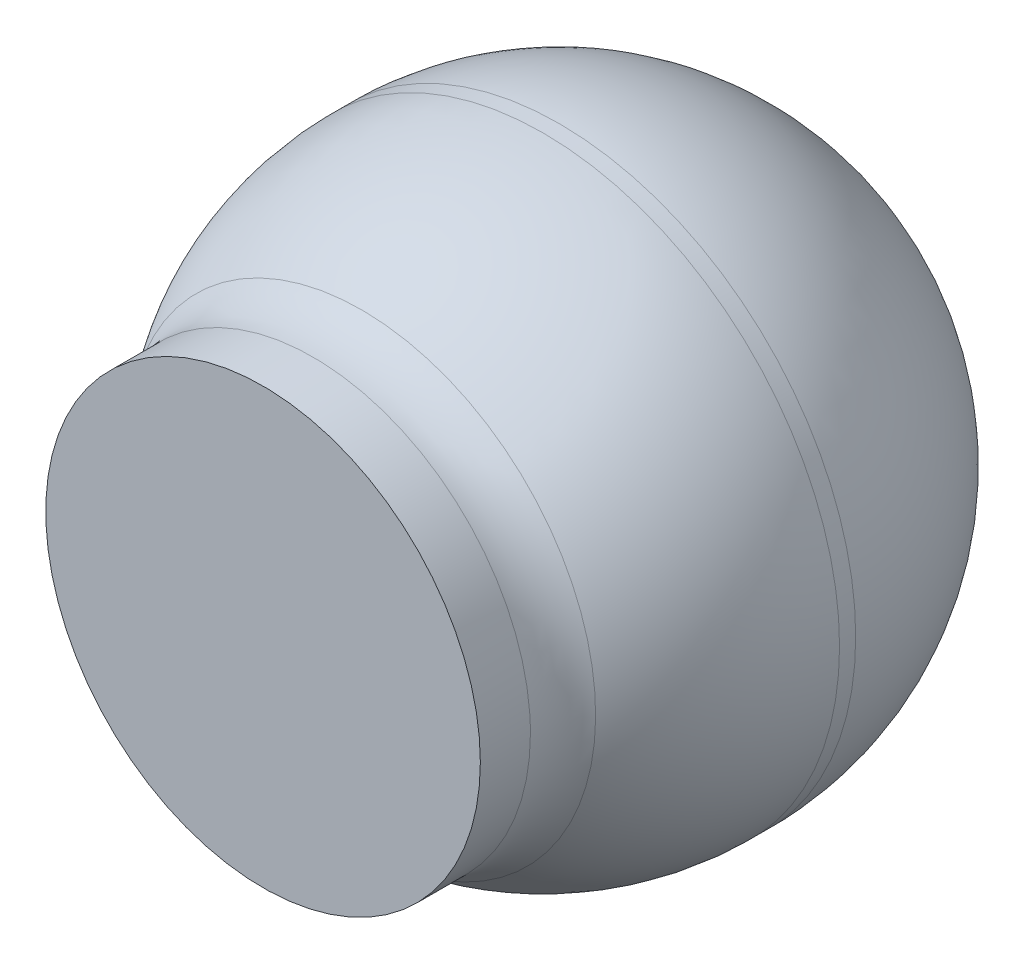
ISO-10303-21;
HEADER;
FILE_DESCRIPTION(('STEP AP214'),'2;1');
FILE_NAME('part.step','',(''),(''),'','','');
FILE_SCHEMA(('AUTOMOTIVE_DESIGN { 1 0 10303 214 1 1 1 1 }'));
ENDSEC;
DATA;
#1=APPLICATION_CONTEXT('core data for automotive mechanical design processes');
#2=APPLICATION_PROTOCOL_DEFINITION('international standard','automotive_design',2000,#1);
#3=PRODUCT_CONTEXT('',#1,'mechanical');
#4=PRODUCT('Part','Part','',(#3));
#5=PRODUCT_RELATED_PRODUCT_CATEGORY('part','',(#4));
#6=PRODUCT_DEFINITION_FORMATION('','',#4);
#7=PRODUCT_DEFINITION_CONTEXT('part definition',#1,'design');
#8=PRODUCT_DEFINITION('design','',#6,#7);
#9=PRODUCT_DEFINITION_SHAPE('','',#8);
#10=(LENGTH_UNIT() NAMED_UNIT(*) SI_UNIT(.MILLI.,.METRE.));
#11=(NAMED_UNIT(*) PLANE_ANGLE_UNIT() SI_UNIT($,.RADIAN.));
#12=(NAMED_UNIT(*) SI_UNIT($,.STERADIAN.) SOLID_ANGLE_UNIT());
#13=UNCERTAINTY_MEASURE_WITH_UNIT(LENGTH_MEASURE(1.E-05),#10,'distance_accuracy_value','');
#14=(GEOMETRIC_REPRESENTATION_CONTEXT(3) GLOBAL_UNCERTAINTY_ASSIGNED_CONTEXT((#13)) GLOBAL_UNIT_ASSIGNED_CONTEXT((#10,
#11,#12)) REPRESENTATION_CONTEXT('',''));
#15=CARTESIAN_POINT('',(0.,0.,0.));
#16=DIRECTION('',(0.,0.,1.));
#17=DIRECTION('',(1.,0.,0.));
#18=AXIS2_PLACEMENT_3D('',#15,#16,#17);
#19=CARTESIAN_POINT('',(-3.102919922269,-0.241349291452,10.006534503384));
#20=DIRECTION('',(0.,0.,-1.));
#21=DIRECTION('',(-1.,0.,0.));
#22=AXIS2_PLACEMENT_3D('',#19,#20,#21);
#23=PLANE('',#22);
#24=CARTESIAN_POINT('',(-3.102919922269,-0.241349291452,10.006534503384));
#25=DIRECTION('',(0.,0.,1.));
#26=DIRECTION('',(1.,0.,0.));
#27=AXIS2_PLACEMENT_3D('',#24,#25,#26);
#28=CIRCLE('',#27,0.275);
#29=CARTESIAN_POINT('',(-2.827919922269,-0.241349291452,10.006534503384));
#30=VERTEX_POINT('',#29);
#31=EDGE_CURVE('E20',#30,#30,#28,.F.);
#32=ORIENTED_EDGE('',*,*,#31,.F.);
#33=EDGE_LOOP('',(#32));
#34=FACE_BOUND('',#33,.T.);
#35=ADVANCED_FACE('F17',(#34),#23,.F.);
#36=CARTESIAN_POINT('',(-3.102919922269,-0.241349291452,9.906534503384));
#37=DIRECTION('',(0.,0.,1.));
#38=DIRECTION('',(1.,0.,0.));
#39=AXIS2_PLACEMENT_3D('',#36,#37,#38);
#40=CYLINDRICAL_SURFACE('',#39,0.275);
#41=CARTESIAN_POINT('',(-3.102919922269,-0.241349291452,9.943180457728));
#42=DIRECTION('',(0.,0.,-1.));
#43=DIRECTION('',(0.996700902337582,0.0811622527992461,0.));
#44=AXIS2_PLACEMENT_3D('',#41,#42,#43);
#45=CIRCLE('',#44,0.275);
#46=CARTESIAN_POINT('',(-2.82882717412616,-0.219029671932207,9.943180457728));
#47=VERTEX_POINT('',#46);
#48=EDGE_CURVE('E65',#47,#47,#45,.F.);
#49=ORIENTED_EDGE('',*,*,#48,.T.);
#50=EDGE_LOOP('',(#49));
#51=FACE_BOUND('',#50,.T.);
#52=ORIENTED_EDGE('',*,*,#31,.T.);
#53=EDGE_LOOP('',(#52));
#54=FACE_BOUND('',#53,.T.);
#55=ADVANCED_FACE('F62',(#51,#54),#40,.T.);
#56=CARTESIAN_POINT('',(-3.102919922269,-0.241349291452,9.943180457728));
#57=DIRECTION('',(0.,0.,-1.));
#58=DIRECTION('',(0.996700902337583,0.081162252799246,0.));
#59=AXIS2_PLACEMENT_3D('',#56,#57,#58);
#60=TOROIDAL_SURFACE('',#59,0.375,0.1);
#61=ORIENTED_EDGE('',*,*,#48,.F.);
#62=EDGE_LOOP('',(#61));
#63=FACE_BOUND('',#62,.T.);
#64=CARTESIAN_POINT('',(-3.102919922269,-0.241349291452,9.881744931236));
#65=DIRECTION('',(0.,0.,-1.));
#66=DIRECTION('',(-0.996700902337598,-0.0811622527990606,0.));
#67=AXIS2_PLACEMENT_3D('',#64,#65,#66);
#68=CIRCLE('',#67,0.296097046412665);
#69=CARTESIAN_POINT('',(-3.398040115608,-0.265381194786,9.881744931236));
#70=VERTEX_POINT('',#69);
#71=EDGE_CURVE('E39',#70,#70,#68,.T.);
#72=ORIENTED_EDGE('',*,*,#71,.F.);
#73=EDGE_LOOP('',(#72));
#74=FACE_BOUND('',#73,.T.);
#75=ADVANCED_FACE('F57',(#63,#74),#60,.F.);
#76=CARTESIAN_POINT('',(-3.476682760645,-0.271785136252,9.651976062157));
#77=CARTESIAN_POINT('',(-3.476682760645,-0.271785136252,9.701461392103));
#78=CARTESIAN_POINT('',(-3.468526217348,-0.271120941579,9.750947004335));
#79=CARTESIAN_POINT('',(-3.452207085349,-0.269792059952,9.798626332798));
#80=CARTESIAN_POINT('',(-3.428341390838,-0.267848654938,9.842699544317));
#81=CARTESIAN_POINT('',(-3.398040115608,-0.265381194786,9.881744931236));
#82=(BOUNDED_CURVE() B_SPLINE_CURVE(5,(#76,#77,#78,#79,#80,#81),.UNSPECIFIED.,.F.,
.F.) B_SPLINE_CURVE_WITH_KNOTS((6,6),(0.,0.661568582165),
.UNSPECIFIED.) CURVE() GEOMETRIC_REPRESENTATION_ITEM() RATIONAL_B_SPLINE_CURVE((1.,1.,1.,1.,1.,1.)) REPRESENTATION_ITEM(''));
#83=CARTESIAN_POINT('',(-3.102919922269,-0.241349291452,9.651976062157));
#84=DIRECTION('',(0.,0.,-1.));
#85=AXIS1_PLACEMENT('',#83,#84);
#86=SURFACE_OF_REVOLUTION('',#82,#85);
#87=CARTESIAN_POINT('',(-3.102919922269,-0.241349291452,9.651976062157));
#88=DIRECTION('',(0.,0.,1.));
#89=DIRECTION('',(1.,0.,0.));
#90=AXIS2_PLACEMENT_3D('',#87,#88,#89);
#91=CIRCLE('',#90,0.375);
#92=CARTESIAN_POINT('',(-2.727919922269,-0.241349291452,9.651976062157));
#93=VERTEX_POINT('',#92);
#94=EDGE_CURVE('E36',#93,#93,#91,.F.);
#95=ORIENTED_EDGE('',*,*,#94,.F.);
#96=EDGE_LOOP('',(#95));
#97=FACE_BOUND('',#96,.T.);
#98=ORIENTED_EDGE('',*,*,#71,.T.);
#99=EDGE_LOOP('',(#98));
#100=FACE_BOUND('',#99,.T.);
#101=ADVANCED_FACE('F53',(#97,#100),#86,.F.);
#102=CARTESIAN_POINT('',(-3.102919922269,-0.241349291452,9.256534503384));
#103=DIRECTION('',(0.,0.,1.));
#104=DIRECTION('',(1.,0.,0.));
#105=AXIS2_PLACEMENT_3D('',#102,#103,#104);
#106=CYLINDRICAL_SURFACE('',#105,0.375);
#107=CARTESIAN_POINT('',(-3.102919922269,-0.241349291452,9.631534503384));
#108=DIRECTION('',(0.,0.,-1.));
#109=DIRECTION('',(0.0811622527992356,-0.996700902337583,0.));
#110=AXIS2_PLACEMENT_3D('',#107,#108,#109);
#111=CIRCLE('',#110,0.375);
#112=CARTESIAN_POINT('',(-3.07248407746929,-0.615112129828594,9.631534503384));
#113=VERTEX_POINT('',#112);
#114=CARTESIAN_POINT('',(-3.13335576706871,0.132413546924594,9.631534503384));
#115=VERTEX_POINT('',#114);
#116=EDGE_CURVE('E11',#113,#115,#111,.T.);
#117=ORIENTED_EDGE('',*,*,#116,.F.);
#118=CARTESIAN_POINT('',(-3.102919922269,-0.241349291452,9.631534503384));
#119=DIRECTION('',(0.,0.,1.));
#120=DIRECTION('',(0.0811622527992365,-0.996700902337583,0.));
#121=AXIS2_PLACEMENT_3D('',#118,#119,#120);
#122=CIRCLE('',#121,0.375);
#123=EDGE_CURVE('E25',#115,#113,#122,.F.);
#124=ORIENTED_EDGE('',*,*,#123,.F.);
#125=EDGE_LOOP('',(#117,#124));
#126=FACE_BOUND('',#125,.T.);
#127=ORIENTED_EDGE('',*,*,#94,.T.);
#128=EDGE_LOOP('',(#127));
#129=FACE_BOUND('',#128,.T.);
#130=ADVANCED_FACE('F34',(#126,#129),#106,.T.);
#131=CARTESIAN_POINT('',(-3.102919922269,-0.241349291452,9.631534503384));
#132=DIRECTION('',(0.0811622527992361,-0.996700902337583,0.));
#133=DIRECTION('',(-0.996700902337583,-0.0811622527992361,0.));
#134=AXIS2_PLACEMENT_3D('',#131,#132,#133);
#135=SPHERICAL_SURFACE('',#134,0.375);
#136=ORIENTED_EDGE('',*,*,#123,.T.);
#137=ORIENTED_EDGE('',*,*,#116,.T.);
#138=EDGE_LOOP('',(#136,#137));
#139=FACE_BOUND('',#138,.T.);
#140=ADVANCED_FACE('F32',(#139),#135,.T.);
#141=CLOSED_SHELL('',(#35,#55,#75,#101,#130,#140));
#142=MANIFOLD_SOLID_BREP('B1',#141);
#143=ADVANCED_BREP_SHAPE_REPRESENTATION('',(#18,#142),#14);
#144=SHAPE_DEFINITION_REPRESENTATION(#9,#143);
ENDSEC;
END-ISO-10303-21;
